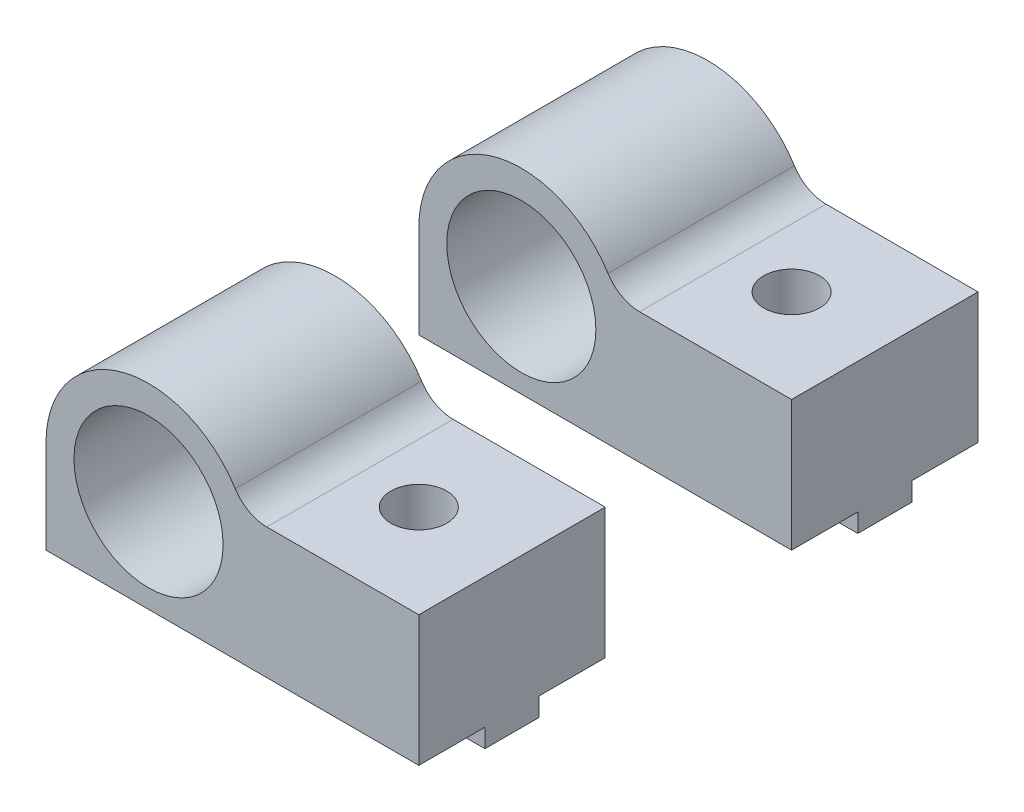
ISO-10303-21;
HEADER;
FILE_DESCRIPTION(('STEP AP214'),'2;1');
FILE_NAME('part.step','',(''),(''),'','','');
FILE_SCHEMA(('AUTOMOTIVE_DESIGN { 1 0 10303 214 1 1 1 1 }'));
ENDSEC;
DATA;
#1=APPLICATION_CONTEXT('core data for automotive mechanical design processes');
#2=APPLICATION_PROTOCOL_DEFINITION('international standard','automotive_design',2000,#1);
#3=PRODUCT_CONTEXT('',#1,'mechanical');
#4=PRODUCT('Part','Part','',(#3));
#5=PRODUCT_RELATED_PRODUCT_CATEGORY('part','',(#4));
#6=PRODUCT_DEFINITION_FORMATION('','',#4);
#7=PRODUCT_DEFINITION_CONTEXT('part definition',#1,'design');
#8=PRODUCT_DEFINITION('design','',#6,#7);
#9=PRODUCT_DEFINITION_SHAPE('','',#8);
#10=(LENGTH_UNIT() NAMED_UNIT(*) SI_UNIT(.MILLI.,.METRE.));
#11=(NAMED_UNIT(*) PLANE_ANGLE_UNIT() SI_UNIT($,.RADIAN.));
#12=(NAMED_UNIT(*) SI_UNIT($,.STERADIAN.) SOLID_ANGLE_UNIT());
#13=UNCERTAINTY_MEASURE_WITH_UNIT(LENGTH_MEASURE(1.E-05),#10,'distance_accuracy_value','');
#14=(GEOMETRIC_REPRESENTATION_CONTEXT(3) GLOBAL_UNCERTAINTY_ASSIGNED_CONTEXT((#13)) GLOBAL_UNIT_ASSIGNED_CONTEXT((#10,
#11,#12)) REPRESENTATION_CONTEXT('',''));
#15=CARTESIAN_POINT('',(0.,0.,0.));
#16=DIRECTION('',(0.,0.,1.));
#17=DIRECTION('',(1.,0.,0.));
#18=AXIS2_PLACEMENT_3D('',#15,#16,#17);
#19=CARTESIAN_POINT('',(-5.5,-6.,-16.45));
#20=DIRECTION('',(0.,0.,1.));
#21=DIRECTION('',(1.,0.,0.));
#22=AXIS2_PLACEMENT_3D('',#19,#20,#21);
#23=PLANE('',#22);
#24=DIRECTION('',(1.,0.,0.));
#25=VECTOR('',#24,1.);
#26=CARTESIAN_POINT('',(-5.5,-6.,-16.45));
#27=LINE('',#26,#25);
#28=CARTESIAN_POINT('',(9.88405728739344,-6.,-16.45));
#29=VERTEX_POINT('',#28);
#30=CARTESIAN_POINT('',(14.5,-6.,-16.45));
#31=VERTEX_POINT('',#30);
#32=EDGE_CURVE('E307',#29,#31,#27,.T.);
#33=ORIENTED_EDGE('',*,*,#32,.F.);
#34=DIRECTION('',(0.,1.,0.));
#35=VECTOR('',#34,1.);
#36=CARTESIAN_POINT('',(9.88405728739344,-6.,-16.45));
#37=LINE('',#36,#35);
#38=CARTESIAN_POINT('',(9.88405728739344,-5.,-16.45));
#39=VERTEX_POINT('',#38);
#40=EDGE_CURVE('E153',#29,#39,#37,.T.);
#41=ORIENTED_EDGE('',*,*,#40,.T.);
#42=DIRECTION('',(1.,0.,0.));
#43=VECTOR('',#42,1.);
#44=CARTESIAN_POINT('',(-5.5,-5.,-16.45));
#45=LINE('',#44,#43);
#46=CARTESIAN_POINT('',(14.5,-5.,-16.45));
#47=VERTEX_POINT('',#46);
#48=EDGE_CURVE('E187',#39,#47,#45,.T.);
#49=ORIENTED_EDGE('',*,*,#48,.T.);
#50=DIRECTION('',(0.,1.,0.));
#51=VECTOR('',#50,1.);
#52=CARTESIAN_POINT('',(14.5,-6.,-16.45));
#53=LINE('',#52,#51);
#54=EDGE_CURVE('E191',#31,#47,#53,.T.);
#55=ORIENTED_EDGE('',*,*,#54,.F.);
#56=EDGE_LOOP('',(#33,#41,#49,#55));
#57=FACE_BOUND('',#56,.T.);
#58=ADVANCED_FACE('F47',(#57),#23,.F.);
#59=CARTESIAN_POINT('',(-5.5,-6.,-13.55));
#60=DIRECTION('',(0.,0.,-1.));
#61=DIRECTION('',(-1.,0.,0.));
#62=AXIS2_PLACEMENT_3D('',#59,#60,#61);
#63=PLANE('',#62);
#64=DIRECTION('',(-1.,0.,0.));
#65=VECTOR('',#64,1.);
#66=CARTESIAN_POINT('',(-5.5,-6.,-13.55));
#67=LINE('',#66,#65);
#68=CARTESIAN_POINT('',(9.11594271260658,-6.,-13.55));
#69=VERTEX_POINT('',#68);
#70=CARTESIAN_POINT('',(-5.5,-6.,-13.55));
#71=VERTEX_POINT('',#70);
#72=EDGE_CURVE('E175',#69,#71,#67,.T.);
#73=ORIENTED_EDGE('',*,*,#72,.F.);
#74=DIRECTION('',(0.,1.,0.));
#75=VECTOR('',#74,1.);
#76=CARTESIAN_POINT('',(9.11594271260658,-6.,-13.55));
#77=LINE('',#76,#75);
#78=CARTESIAN_POINT('',(9.11594271260658,-5.,-13.55));
#79=VERTEX_POINT('',#78);
#80=EDGE_CURVE('E302',#69,#79,#77,.T.);
#81=ORIENTED_EDGE('',*,*,#80,.T.);
#82=DIRECTION('',(-1.,0.,0.));
#83=VECTOR('',#82,1.);
#84=CARTESIAN_POINT('',(-5.5,-5.,-13.55));
#85=LINE('',#84,#83);
#86=CARTESIAN_POINT('',(-5.5,-5.,-13.55));
#87=VERTEX_POINT('',#86);
#88=EDGE_CURVE('E186',#79,#87,#85,.T.);
#89=ORIENTED_EDGE('',*,*,#88,.T.);
#90=DIRECTION('',(0.,1.,0.));
#91=VECTOR('',#90,1.);
#92=CARTESIAN_POINT('',(-5.5,-6.,-13.55));
#93=LINE('',#92,#91);
#94=EDGE_CURVE('E174',#71,#87,#93,.T.);
#95=ORIENTED_EDGE('',*,*,#94,.F.);
#96=EDGE_LOOP('',(#73,#81,#89,#95));
#97=FACE_BOUND('',#96,.T.);
#98=ADVANCED_FACE('F272',(#97),#63,.F.);
#99=CARTESIAN_POINT('',(0.,-6.,-20.));
#100=DIRECTION('',(0.,-1.,0.));
#101=DIRECTION('',(0.,0.,-1.));
#102=AXIS2_PLACEMENT_3D('',#99,#100,#101);
#103=PLANE('',#102);
#104=CARTESIAN_POINT('',(9.50000000000001,-6.,-15.));
#105=DIRECTION('',(0.,-1.,0.));
#106=DIRECTION('',(0.,0.,-1.));
#107=AXIS2_PLACEMENT_3D('',#104,#105,#106);
#108=CIRCLE('',#107,1.5);
#109=CARTESIAN_POINT('',(9.88405728739344,-6.,-13.55));
#110=VERTEX_POINT('',#109);
#111=EDGE_CURVE('E147',#29,#110,#108,.T.);
#112=ORIENTED_EDGE('',*,*,#111,.F.);
#113=ORIENTED_EDGE('',*,*,#32,.T.);
#114=DIRECTION('',(0.,0.,1.));
#115=VECTOR('',#114,1.);
#116=CARTESIAN_POINT('',(14.5,-6.,-13.55));
#117=LINE('',#116,#115);
#118=CARTESIAN_POINT('',(14.5,-6.,-13.55));
#119=VERTEX_POINT('',#118);
#120=EDGE_CURVE('E172',#31,#119,#117,.T.);
#121=ORIENTED_EDGE('',*,*,#120,.T.);
#122=EDGE_CURVE('E165',#119,#110,#67,.T.);
#123=ORIENTED_EDGE('',*,*,#122,.T.);
#124=EDGE_LOOP('',(#112,#113,#121,#123));
#125=FACE_BOUND('',#124,.T.);
#126=ADVANCED_FACE('F170',(#125),#103,.T.);
#127=CARTESIAN_POINT('',(-5.5,-5.,-10.));
#128=DIRECTION('',(0.,1.,0.));
#129=DIRECTION('',(0.,0.,1.));
#130=AXIS2_PLACEMENT_3D('',#127,#128,#129);
#131=PLANE('',#130);
#132=ORIENTED_EDGE('',*,*,#88,.F.);
#133=CARTESIAN_POINT('',(9.50000000000001,-5.,-15.));
#134=DIRECTION('',(0.,1.,0.));
#135=DIRECTION('',(0.,0.,1.));
#136=AXIS2_PLACEMENT_3D('',#133,#134,#135);
#137=CIRCLE('',#136,1.5);
#138=CARTESIAN_POINT('',(9.88405728739344,-5.,-13.55));
#139=VERTEX_POINT('',#138);
#140=EDGE_CURVE('E167',#79,#139,#137,.T.);
#141=ORIENTED_EDGE('',*,*,#140,.T.);
#142=CARTESIAN_POINT('',(14.5,-5.,-13.55));
#143=VERTEX_POINT('',#142);
#144=EDGE_CURVE('E166',#143,#139,#85,.T.);
#145=ORIENTED_EDGE('',*,*,#144,.F.);
#146=DIRECTION('',(0.,0.,-1.));
#147=VECTOR('',#146,1.);
#148=CARTESIAN_POINT('',(14.5,-5.,-10.));
#149=LINE('',#148,#147);
#150=CARTESIAN_POINT('',(14.5,-5.,-10.));
#151=VERTEX_POINT('',#150);
#152=EDGE_CURVE('E229',#151,#143,#149,.T.);
#153=ORIENTED_EDGE('',*,*,#152,.F.);
#154=DIRECTION('',(1.,0.,0.));
#155=VECTOR('',#154,1.);
#156=CARTESIAN_POINT('',(-5.5,-5.,-10.));
#157=LINE('',#156,#155);
#158=CARTESIAN_POINT('',(-5.5,-5.,-10.));
#159=VERTEX_POINT('',#158);
#160=EDGE_CURVE('E211',#159,#151,#157,.T.);
#161=ORIENTED_EDGE('',*,*,#160,.F.);
#162=DIRECTION('',(0.,0.,-1.));
#163=VECTOR('',#162,1.);
#164=CARTESIAN_POINT('',(-5.5,-5.,-10.));
#165=LINE('',#164,#163);
#166=EDGE_CURVE('E233',#159,#87,#165,.T.);
#167=ORIENTED_EDGE('',*,*,#166,.T.);
#168=EDGE_LOOP('',(#132,#141,#145,#153,#161,#167));
#169=FACE_BOUND('',#168,.T.);
#170=ADVANCED_FACE('F317',(#169),#131,.F.);
#171=ORIENTED_EDGE('',*,*,#48,.F.);
#172=CARTESIAN_POINT('',(9.50000000000001,-5.,-15.));
#173=DIRECTION('',(0.,1.,0.));
#174=DIRECTION('',(0.,0.,1.));
#175=AXIS2_PLACEMENT_3D('',#172,#173,#174);
#176=CIRCLE('',#175,1.5);
#177=CARTESIAN_POINT('',(9.11594271260657,-5.,-16.45));
#178=VERTEX_POINT('',#177);
#179=EDGE_CURVE('E298',#39,#178,#176,.T.);
#180=ORIENTED_EDGE('',*,*,#179,.T.);
#181=CARTESIAN_POINT('',(-5.5,-5.,-16.45));
#182=VERTEX_POINT('',#181);
#183=EDGE_CURVE('E183',#182,#178,#45,.T.);
#184=ORIENTED_EDGE('',*,*,#183,.F.);
#185=CARTESIAN_POINT('',(-5.5,-5.,-20.));
#186=VERTEX_POINT('',#185);
#187=EDGE_CURVE('E232',#182,#186,#165,.T.);
#188=ORIENTED_EDGE('',*,*,#187,.T.);
#189=DIRECTION('',(1.,0.,0.));
#190=VECTOR('',#189,1.);
#191=CARTESIAN_POINT('',(-5.5,-5.,-20.));
#192=LINE('',#191,#190);
#193=CARTESIAN_POINT('',(14.5,-5.,-20.));
#194=VERTEX_POINT('',#193);
#195=EDGE_CURVE('E222',#186,#194,#192,.T.);
#196=ORIENTED_EDGE('',*,*,#195,.T.);
#197=EDGE_CURVE('E228',#47,#194,#149,.T.);
#198=ORIENTED_EDGE('',*,*,#197,.F.);
#199=EDGE_LOOP('',(#171,#180,#184,#188,#196,#198));
#200=FACE_BOUND('',#199,.T.);
#201=ADVANCED_FACE('F297',(#200),#131,.F.);
#202=CARTESIAN_POINT('',(0.,0.,-10.));
#203=DIRECTION('',(0.,0.,-1.));
#204=DIRECTION('',(-1.,0.,0.));
#205=AXIS2_PLACEMENT_3D('',#202,#203,#204);
#206=PLANE('',#205);
#207=DIRECTION('',(-1.,0.,0.));
#208=VECTOR('',#207,1.);
#209=CARTESIAN_POINT('',(14.5,2.,-10.));
#210=LINE('',#209,#208);
#211=CARTESIAN_POINT('',(14.5,2.,-10.));
#212=VERTEX_POINT('',#211);
#213=CARTESIAN_POINT('',(6.34428877022476,2.,-10.));
#214=VERTEX_POINT('',#213);
#215=EDGE_CURVE('E204',#212,#214,#210,.T.);
#216=ORIENTED_EDGE('',*,*,#215,.T.);
#217=CARTESIAN_POINT('',(6.34428877022476,4.,-10.));
#218=DIRECTION('',(0.,0.,-1.));
#219=DIRECTION('',(-1.,0.,0.));
#220=AXIS2_PLACEMENT_3D('',#217,#218,#219);
#221=CIRCLE('',#220,2.);
#222=CARTESIAN_POINT('',(4.65247843149816,2.93333333333333,-10.));
#223=VERTEX_POINT('',#222);
#224=EDGE_CURVE('E12',#214,#223,#221,.T.);
#225=ORIENTED_EDGE('',*,*,#224,.T.);
#226=CARTESIAN_POINT('',(0.,0.,-10.));
#227=DIRECTION('',(0.,0.,1.));
#228=DIRECTION('',(-1.,0.,0.));
#229=AXIS2_PLACEMENT_3D('',#226,#227,#228);
#230=CIRCLE('',#229,5.5);
#231=CARTESIAN_POINT('',(-5.5,0.,-10.));
#232=VERTEX_POINT('',#231);
#233=EDGE_CURVE('E206',#223,#232,#230,.T.);
#234=ORIENTED_EDGE('',*,*,#233,.T.);
#235=DIRECTION('',(0.,-1.,0.));
#236=VECTOR('',#235,1.);
#237=CARTESIAN_POINT('',(-5.5,0.,-10.));
#238=LINE('',#237,#236);
#239=EDGE_CURVE('E209',#232,#159,#238,.T.);
#240=ORIENTED_EDGE('',*,*,#239,.T.);
#241=ORIENTED_EDGE('',*,*,#160,.T.);
#242=DIRECTION('',(0.,1.,0.));
#243=VECTOR('',#242,1.);
#244=CARTESIAN_POINT('',(14.5,-5.,-10.));
#245=LINE('',#244,#243);
#246=EDGE_CURVE('E213',#151,#212,#245,.T.);
#247=ORIENTED_EDGE('',*,*,#246,.T.);
#248=EDGE_LOOP('',(#216,#225,#234,#240,#241,#247));
#249=FACE_BOUND('',#248,.T.);
#250=CARTESIAN_POINT('',(0.,0.,-10.));
#251=DIRECTION('',(0.,0.,1.));
#252=DIRECTION('',(1.,0.,0.));
#253=AXIS2_PLACEMENT_3D('',#250,#251,#252);
#254=CIRCLE('',#253,4.);
#255=CARTESIAN_POINT('',(4.,0.,-10.));
#256=VERTEX_POINT('',#255);
#257=EDGE_CURVE('E198',#256,#256,#254,.T.);
#258=ORIENTED_EDGE('',*,*,#257,.F.);
#259=EDGE_LOOP('',(#258));
#260=FACE_BOUND('',#259,.T.);
#261=ADVANCED_FACE('F261',(#249,#260),#206,.F.);
#262=CARTESIAN_POINT('',(0.,0.,-20.));
#263=DIRECTION('',(0.,0.,-1.));
#264=DIRECTION('',(-1.,0.,0.));
#265=AXIS2_PLACEMENT_3D('',#262,#263,#264);
#266=PLANE('',#265);
#267=DIRECTION('',(-1.,0.,0.));
#268=VECTOR('',#267,1.);
#269=CARTESIAN_POINT('',(14.5,2.,-20.));
#270=LINE('',#269,#268);
#271=CARTESIAN_POINT('',(14.5,2.,-20.));
#272=VERTEX_POINT('',#271);
#273=CARTESIAN_POINT('',(6.34428877022476,2.,-20.));
#274=VERTEX_POINT('',#273);
#275=EDGE_CURVE('E201',#272,#274,#270,.T.);
#276=ORIENTED_EDGE('',*,*,#275,.F.);
#277=DIRECTION('',(0.,1.,0.));
#278=VECTOR('',#277,1.);
#279=CARTESIAN_POINT('',(14.5,-5.,-20.));
#280=LINE('',#279,#278);
#281=EDGE_CURVE('E207',#194,#272,#280,.T.);
#282=ORIENTED_EDGE('',*,*,#281,.F.);
#283=ORIENTED_EDGE('',*,*,#195,.F.);
#284=DIRECTION('',(0.,-1.,0.));
#285=VECTOR('',#284,1.);
#286=CARTESIAN_POINT('',(-5.5,0.,-20.));
#287=LINE('',#286,#285);
#288=CARTESIAN_POINT('',(-5.5,0.,-20.));
#289=VERTEX_POINT('',#288);
#290=EDGE_CURVE('E219',#289,#186,#287,.T.);
#291=ORIENTED_EDGE('',*,*,#290,.F.);
#292=CARTESIAN_POINT('',(0.,0.,-20.));
#293=DIRECTION('',(0.,0.,1.));
#294=DIRECTION('',(-1.,0.,0.));
#295=AXIS2_PLACEMENT_3D('',#292,#293,#294);
#296=CIRCLE('',#295,5.5);
#297=CARTESIAN_POINT('',(4.65247843149816,2.93333333333333,-20.));
#298=VERTEX_POINT('',#297);
#299=EDGE_CURVE('E217',#298,#289,#296,.T.);
#300=ORIENTED_EDGE('',*,*,#299,.F.);
#301=CARTESIAN_POINT('',(6.34428877022476,4.,-20.));
#302=DIRECTION('',(0.,0.,-1.));
#303=DIRECTION('',(-1.,0.,0.));
#304=AXIS2_PLACEMENT_3D('',#301,#302,#303);
#305=CIRCLE('',#304,2.);
#306=EDGE_CURVE('E55',#298,#274,#305,.F.);
#307=ORIENTED_EDGE('',*,*,#306,.T.);
#308=EDGE_LOOP('',(#276,#282,#283,#291,#300,#307));
#309=FACE_BOUND('',#308,.T.);
#310=CARTESIAN_POINT('',(0.,0.,-20.));
#311=DIRECTION('',(0.,0.,1.));
#312=DIRECTION('',(1.,0.,0.));
#313=AXIS2_PLACEMENT_3D('',#310,#311,#312);
#314=CIRCLE('',#313,4.);
#315=CARTESIAN_POINT('',(4.,0.,-20.));
#316=VERTEX_POINT('',#315);
#317=EDGE_CURVE('E197',#316,#316,#314,.T.);
#318=ORIENTED_EDGE('',*,*,#317,.T.);
#319=EDGE_LOOP('',(#318));
#320=FACE_BOUND('',#319,.T.);
#321=ADVANCED_FACE('F249',(#309,#320),#266,.T.);
#322=CARTESIAN_POINT('',(14.5,2.,-10.));
#323=DIRECTION('',(0.,-1.,0.));
#324=DIRECTION('',(1.,0.,0.));
#325=AXIS2_PLACEMENT_3D('',#322,#323,#324);
#326=PLANE('',#325);
#327=CARTESIAN_POINT('',(9.50000000000001,2.,-15.));
#328=DIRECTION('',(0.,1.,0.));
#329=DIRECTION('',(-1.,0.,0.));
#330=AXIS2_PLACEMENT_3D('',#327,#328,#329);
#331=CIRCLE('',#330,1.5);
#332=CARTESIAN_POINT('',(8.,2.,-15.));
#333=VERTEX_POINT('',#332);
#334=EDGE_CURVE('E168',#333,#333,#331,.T.);
#335=ORIENTED_EDGE('',*,*,#334,.F.);
#336=EDGE_LOOP('',(#335));
#337=FACE_BOUND('',#336,.T.);
#338=ORIENTED_EDGE('',*,*,#275,.T.);
#339=DIRECTION('',(0.,0.,1.));
#340=VECTOR('',#339,1.);
#341=CARTESIAN_POINT('',(6.34428877022476,2.,-10.));
#342=LINE('',#341,#340);
#343=EDGE_CURVE('E62',#274,#214,#342,.T.);
#344=ORIENTED_EDGE('',*,*,#343,.T.);
#345=ORIENTED_EDGE('',*,*,#215,.F.);
#346=DIRECTION('',(0.,0.,-1.));
#347=VECTOR('',#346,1.);
#348=CARTESIAN_POINT('',(14.5,2.,-10.));
#349=LINE('',#348,#347);
#350=EDGE_CURVE('E215',#212,#272,#349,.T.);
#351=ORIENTED_EDGE('',*,*,#350,.T.);
#352=EDGE_LOOP('',(#338,#344,#345,#351));
#353=FACE_BOUND('',#352,.T.);
#354=ADVANCED_FACE('F324',(#337,#353),#326,.F.);
#355=CARTESIAN_POINT('',(0.,0.,-10.));
#356=DIRECTION('',(0.,0.,-1.));
#357=DIRECTION('',(-1.,0.,0.));
#358=AXIS2_PLACEMENT_3D('',#355,#356,#357);
#359=CYLINDRICAL_SURFACE('',#358,5.5);
#360=ORIENTED_EDGE('',*,*,#233,.F.);
#361=DIRECTION('',(0.,0.,-1.));
#362=VECTOR('',#361,1.);
#363=CARTESIAN_POINT('',(4.65247843149816,2.93333333333333,-10.));
#364=LINE('',#363,#362);
#365=EDGE_CURVE('E157',#223,#298,#364,.T.);
#366=ORIENTED_EDGE('',*,*,#365,.T.);
#367=ORIENTED_EDGE('',*,*,#299,.T.);
#368=DIRECTION('',(0.,0.,-1.));
#369=VECTOR('',#368,1.);
#370=CARTESIAN_POINT('',(-5.5,0.,-10.));
#371=LINE('',#370,#369);
#372=EDGE_CURVE('E236',#232,#289,#371,.T.);
#373=ORIENTED_EDGE('',*,*,#372,.F.);
#374=EDGE_LOOP('',(#360,#366,#367,#373));
#375=FACE_BOUND('',#374,.T.);
#376=ADVANCED_FACE('F244',(#375),#359,.T.);
#377=CARTESIAN_POINT('',(-5.5,0.,-10.));
#378=DIRECTION('',(1.,0.,0.));
#379=DIRECTION('',(0.,1.,0.));
#380=AXIS2_PLACEMENT_3D('',#377,#378,#379);
#381=PLANE('',#380);
#382=ORIENTED_EDGE('',*,*,#290,.T.);
#383=ORIENTED_EDGE('',*,*,#187,.F.);
#384=DIRECTION('',(0.,1.,0.));
#385=VECTOR('',#384,1.);
#386=CARTESIAN_POINT('',(-5.5,-6.,-16.45));
#387=LINE('',#386,#385);
#388=CARTESIAN_POINT('',(-5.5,-6.,-16.45));
#389=VERTEX_POINT('',#388);
#390=EDGE_CURVE('E194',#389,#182,#387,.T.);
#391=ORIENTED_EDGE('',*,*,#390,.F.);
#392=DIRECTION('',(0.,0.,-1.));
#393=VECTOR('',#392,1.);
#394=CARTESIAN_POINT('',(-5.5,-6.,-13.55));
#395=LINE('',#394,#393);
#396=EDGE_CURVE('E188',#71,#389,#395,.T.);
#397=ORIENTED_EDGE('',*,*,#396,.F.);
#398=ORIENTED_EDGE('',*,*,#94,.T.);
#399=ORIENTED_EDGE('',*,*,#166,.F.);
#400=ORIENTED_EDGE('',*,*,#239,.F.);
#401=ORIENTED_EDGE('',*,*,#372,.T.);
#402=EDGE_LOOP('',(#382,#383,#391,#397,#398,#399,#400,#401));
#403=FACE_BOUND('',#402,.T.);
#404=ADVANCED_FACE('F255',(#403),#381,.F.);
#405=CARTESIAN_POINT('',(14.5,-5.,-10.));
#406=DIRECTION('',(-1.,0.,0.));
#407=DIRECTION('',(0.,-1.,0.));
#408=AXIS2_PLACEMENT_3D('',#405,#406,#407);
#409=PLANE('',#408);
#410=ORIENTED_EDGE('',*,*,#281,.T.);
#411=ORIENTED_EDGE('',*,*,#350,.F.);
#412=ORIENTED_EDGE('',*,*,#246,.F.);
#413=ORIENTED_EDGE('',*,*,#152,.T.);
#414=DIRECTION('',(0.,1.,0.));
#415=VECTOR('',#414,1.);
#416=CARTESIAN_POINT('',(14.5,-6.,-13.55));
#417=LINE('',#416,#415);
#418=EDGE_CURVE('E178',#119,#143,#417,.T.);
#419=ORIENTED_EDGE('',*,*,#418,.F.);
#420=ORIENTED_EDGE('',*,*,#120,.F.);
#421=ORIENTED_EDGE('',*,*,#54,.T.);
#422=ORIENTED_EDGE('',*,*,#197,.T.);
#423=EDGE_LOOP('',(#410,#411,#412,#413,#419,#420,#421,#422));
#424=FACE_BOUND('',#423,.T.);
#425=ADVANCED_FACE('F289',(#424),#409,.F.);
#426=CARTESIAN_POINT('',(0.,0.,-10.));
#427=DIRECTION('',(0.,0.,-1.));
#428=DIRECTION('',(-1.,0.,0.));
#429=AXIS2_PLACEMENT_3D('',#426,#427,#428);
#430=CYLINDRICAL_SURFACE('',#429,4.);
#431=ORIENTED_EDGE('',*,*,#257,.T.);
#432=EDGE_LOOP('',(#431));
#433=FACE_BOUND('',#432,.T.);
#434=ORIENTED_EDGE('',*,*,#317,.F.);
#435=EDGE_LOOP('',(#434));
#436=FACE_BOUND('',#435,.T.);
#437=ADVANCED_FACE('F283',(#433,#436),#430,.F.);
#438=ORIENTED_EDGE('',*,*,#183,.T.);
#439=DIRECTION('',(0.,1.,0.));
#440=VECTOR('',#439,1.);
#441=CARTESIAN_POINT('',(9.11594271260657,-6.,-16.45));
#442=LINE('',#441,#440);
#443=CARTESIAN_POINT('',(9.11594271260657,-6.,-16.45));
#444=VERTEX_POINT('',#443);
#445=EDGE_CURVE('E292',#178,#444,#442,.F.);
#446=ORIENTED_EDGE('',*,*,#445,.T.);
#447=EDGE_CURVE('E308',#389,#444,#27,.T.);
#448=ORIENTED_EDGE('',*,*,#447,.F.);
#449=ORIENTED_EDGE('',*,*,#390,.T.);
#450=EDGE_LOOP('',(#438,#446,#448,#449));
#451=FACE_BOUND('',#450,.T.);
#452=ADVANCED_FACE('F275',(#451),#23,.F.);
#453=ORIENTED_EDGE('',*,*,#144,.T.);
#454=DIRECTION('',(0.,1.,0.));
#455=VECTOR('',#454,1.);
#456=CARTESIAN_POINT('',(9.88405728739344,-6.,-13.55));
#457=LINE('',#456,#455);
#458=EDGE_CURVE('E150',#139,#110,#457,.F.);
#459=ORIENTED_EDGE('',*,*,#458,.T.);
#460=ORIENTED_EDGE('',*,*,#122,.F.);
#461=ORIENTED_EDGE('',*,*,#418,.T.);
#462=EDGE_LOOP('',(#453,#459,#460,#461));
#463=FACE_BOUND('',#462,.T.);
#464=ADVANCED_FACE('F163',(#463),#63,.F.);
#465=EDGE_CURVE('E158',#69,#444,#108,.T.);
#466=ORIENTED_EDGE('',*,*,#465,.F.);
#467=ORIENTED_EDGE('',*,*,#72,.T.);
#468=ORIENTED_EDGE('',*,*,#396,.T.);
#469=ORIENTED_EDGE('',*,*,#447,.T.);
#470=EDGE_LOOP('',(#466,#467,#468,#469));
#471=FACE_BOUND('',#470,.T.);
#472=ADVANCED_FACE('F268',(#471),#103,.T.);
#473=CARTESIAN_POINT('',(9.50000000000001,-6.,-15.));
#474=DIRECTION('',(0.,1.,0.));
#475=DIRECTION('',(-1.,0.,0.));
#476=AXIS2_PLACEMENT_3D('',#473,#474,#475);
#477=CYLINDRICAL_SURFACE('',#476,1.5);
#478=ORIENTED_EDGE('',*,*,#334,.T.);
#479=EDGE_LOOP('',(#478));
#480=FACE_BOUND('',#479,.T.);
#481=ORIENTED_EDGE('',*,*,#111,.T.);
#482=ORIENTED_EDGE('',*,*,#458,.F.);
#483=ORIENTED_EDGE('',*,*,#140,.F.);
#484=ORIENTED_EDGE('',*,*,#80,.F.);
#485=ORIENTED_EDGE('',*,*,#465,.T.);
#486=ORIENTED_EDGE('',*,*,#445,.F.);
#487=ORIENTED_EDGE('',*,*,#179,.F.);
#488=ORIENTED_EDGE('',*,*,#40,.F.);
#489=EDGE_LOOP('',(#481,#482,#483,#484,#485,#486,#487,#488));
#490=FACE_BOUND('',#489,.T.);
#491=ADVANCED_FACE('F149',(#480,#490),#477,.F.);
#492=CARTESIAN_POINT('',(6.34428877022476,4.,-10.));
#493=DIRECTION('',(0.,0.,-1.));
#494=DIRECTION('',(-1.,0.,0.));
#495=AXIS2_PLACEMENT_3D('',#492,#493,#494);
#496=CYLINDRICAL_SURFACE('',#495,2.);
#497=ORIENTED_EDGE('',*,*,#224,.F.);
#498=ORIENTED_EDGE('',*,*,#343,.F.);
#499=ORIENTED_EDGE('',*,*,#306,.F.);
#500=ORIENTED_EDGE('',*,*,#365,.F.);
#501=EDGE_LOOP('',(#497,#498,#499,#500));
#502=FACE_BOUND('',#501,.T.);
#503=ADVANCED_FACE('F49',(#502),#496,.F.);
#504=CLOSED_SHELL('',(#58,#98,#126,#170,#201,#261,#321,#354,#376,#404,#425,#437,#452,#464,#472,
#491,#503));
#505=MANIFOLD_SOLID_BREP('B2_NOT_SHOWN',#504);
#506=CARTESIAN_POINT('',(-5.5,-6.,3.55));
#507=DIRECTION('',(0.,0.,1.));
#508=DIRECTION('',(1.,0.,0.));
#509=AXIS2_PLACEMENT_3D('',#506,#507,#508);
#510=PLANE('',#509);
#511=DIRECTION('',(1.,0.,0.));
#512=VECTOR('',#511,1.);
#513=CARTESIAN_POINT('',(-5.5,-6.,3.55));
#514=LINE('',#513,#512);
#515=CARTESIAN_POINT('',(9.88405728739344,-6.,3.55));
#516=VERTEX_POINT('',#515);
#517=CARTESIAN_POINT('',(14.5,-6.,3.55));
#518=VERTEX_POINT('',#517);
#519=EDGE_CURVE('E713',#516,#518,#514,.T.);
#520=ORIENTED_EDGE('',*,*,#519,.F.);
#521=DIRECTION('',(0.,1.,0.));
#522=VECTOR('',#521,1.);
#523=CARTESIAN_POINT('',(9.88405728739344,-6.,3.55));
#524=LINE('',#523,#522);
#525=CARTESIAN_POINT('',(9.88405728739344,-5.,3.55));
#526=VERTEX_POINT('',#525);
#527=EDGE_CURVE('E559',#516,#526,#524,.T.);
#528=ORIENTED_EDGE('',*,*,#527,.T.);
#529=DIRECTION('',(1.,0.,0.));
#530=VECTOR('',#529,1.);
#531=CARTESIAN_POINT('',(-5.5,-5.,3.55));
#532=LINE('',#531,#530);
#533=CARTESIAN_POINT('',(14.5,-5.,3.55));
#534=VERTEX_POINT('',#533);
#535=EDGE_CURVE('E593',#526,#534,#532,.T.);
#536=ORIENTED_EDGE('',*,*,#535,.T.);
#537=DIRECTION('',(0.,1.,0.));
#538=VECTOR('',#537,1.);
#539=CARTESIAN_POINT('',(14.5,-6.,3.55));
#540=LINE('',#539,#538);
#541=EDGE_CURVE('E597',#518,#534,#540,.T.);
#542=ORIENTED_EDGE('',*,*,#541,.F.);
#543=EDGE_LOOP('',(#520,#528,#536,#542));
#544=FACE_BOUND('',#543,.T.);
#545=ADVANCED_FACE('F453',(#544),#510,.F.);
#546=CARTESIAN_POINT('',(-5.5,-6.,6.45));
#547=DIRECTION('',(0.,0.,-1.));
#548=DIRECTION('',(-1.,0.,0.));
#549=AXIS2_PLACEMENT_3D('',#546,#547,#548);
#550=PLANE('',#549);
#551=DIRECTION('',(-1.,0.,0.));
#552=VECTOR('',#551,1.);
#553=CARTESIAN_POINT('',(-5.5,-6.,6.45));
#554=LINE('',#553,#552);
#555=CARTESIAN_POINT('',(9.11594271260658,-6.,6.45));
#556=VERTEX_POINT('',#555);
#557=CARTESIAN_POINT('',(-5.5,-6.,6.45));
#558=VERTEX_POINT('',#557);
#559=EDGE_CURVE('E581',#556,#558,#554,.T.);
#560=ORIENTED_EDGE('',*,*,#559,.F.);
#561=DIRECTION('',(0.,1.,0.));
#562=VECTOR('',#561,1.);
#563=CARTESIAN_POINT('',(9.11594271260658,-6.,6.45));
#564=LINE('',#563,#562);
#565=CARTESIAN_POINT('',(9.11594271260658,-5.,6.45));
#566=VERTEX_POINT('',#565);
#567=EDGE_CURVE('E708',#556,#566,#564,.T.);
#568=ORIENTED_EDGE('',*,*,#567,.T.);
#569=DIRECTION('',(-1.,0.,0.));
#570=VECTOR('',#569,1.);
#571=CARTESIAN_POINT('',(-5.5,-5.,6.45));
#572=LINE('',#571,#570);
#573=CARTESIAN_POINT('',(-5.5,-5.,6.45));
#574=VERTEX_POINT('',#573);
#575=EDGE_CURVE('E592',#566,#574,#572,.T.);
#576=ORIENTED_EDGE('',*,*,#575,.T.);
#577=DIRECTION('',(0.,1.,0.));
#578=VECTOR('',#577,1.);
#579=CARTESIAN_POINT('',(-5.5,-6.,6.45));
#580=LINE('',#579,#578);
#581=EDGE_CURVE('E580',#558,#574,#580,.T.);
#582=ORIENTED_EDGE('',*,*,#581,.F.);
#583=EDGE_LOOP('',(#560,#568,#576,#582));
#584=FACE_BOUND('',#583,.T.);
#585=ADVANCED_FACE('F678',(#584),#550,.F.);
#586=CARTESIAN_POINT('',(0.,-6.,0.));
#587=DIRECTION('',(0.,-1.,0.));
#588=DIRECTION('',(0.,0.,-1.));
#589=AXIS2_PLACEMENT_3D('',#586,#587,#588);
#590=PLANE('',#589);
#591=CARTESIAN_POINT('',(9.50000000000001,-6.,5.));
#592=DIRECTION('',(0.,-1.,0.));
#593=DIRECTION('',(0.,0.,-1.));
#594=AXIS2_PLACEMENT_3D('',#591,#592,#593);
#595=CIRCLE('',#594,1.5);
#596=CARTESIAN_POINT('',(9.88405728739344,-6.,6.45));
#597=VERTEX_POINT('',#596);
#598=EDGE_CURVE('E553',#516,#597,#595,.T.);
#599=ORIENTED_EDGE('',*,*,#598,.F.);
#600=ORIENTED_EDGE('',*,*,#519,.T.);
#601=DIRECTION('',(0.,0.,1.));
#602=VECTOR('',#601,1.);
#603=CARTESIAN_POINT('',(14.5,-6.,6.45));
#604=LINE('',#603,#602);
#605=CARTESIAN_POINT('',(14.5,-6.,6.45));
#606=VERTEX_POINT('',#605);
#607=EDGE_CURVE('E578',#518,#606,#604,.T.);
#608=ORIENTED_EDGE('',*,*,#607,.T.);
#609=EDGE_CURVE('E571',#606,#597,#554,.T.);
#610=ORIENTED_EDGE('',*,*,#609,.T.);
#611=EDGE_LOOP('',(#599,#600,#608,#610));
#612=FACE_BOUND('',#611,.T.);
#613=ADVANCED_FACE('F576',(#612),#590,.T.);
#614=CARTESIAN_POINT('',(-5.5,-5.,10.));
#615=DIRECTION('',(0.,1.,0.));
#616=DIRECTION('',(0.,0.,1.));
#617=AXIS2_PLACEMENT_3D('',#614,#615,#616);
#618=PLANE('',#617);
#619=ORIENTED_EDGE('',*,*,#575,.F.);
#620=CARTESIAN_POINT('',(9.50000000000001,-5.,5.));
#621=DIRECTION('',(0.,1.,0.));
#622=DIRECTION('',(0.,0.,1.));
#623=AXIS2_PLACEMENT_3D('',#620,#621,#622);
#624=CIRCLE('',#623,1.5);
#625=CARTESIAN_POINT('',(9.88405728739344,-5.,6.45));
#626=VERTEX_POINT('',#625);
#627=EDGE_CURVE('E573',#566,#626,#624,.T.);
#628=ORIENTED_EDGE('',*,*,#627,.T.);
#629=CARTESIAN_POINT('',(14.5,-5.,6.45));
#630=VERTEX_POINT('',#629);
#631=EDGE_CURVE('E572',#630,#626,#572,.T.);
#632=ORIENTED_EDGE('',*,*,#631,.F.);
#633=DIRECTION('',(0.,0.,-1.));
#634=VECTOR('',#633,1.);
#635=CARTESIAN_POINT('',(14.5,-5.,10.));
#636=LINE('',#635,#634);
#637=CARTESIAN_POINT('',(14.5,-5.,10.));
#638=VERTEX_POINT('',#637);
#639=EDGE_CURVE('E635',#638,#630,#636,.T.);
#640=ORIENTED_EDGE('',*,*,#639,.F.);
#641=DIRECTION('',(1.,0.,0.));
#642=VECTOR('',#641,1.);
#643=CARTESIAN_POINT('',(-5.5,-5.,10.));
#644=LINE('',#643,#642);
#645=CARTESIAN_POINT('',(-5.5,-5.,10.));
#646=VERTEX_POINT('',#645);
#647=EDGE_CURVE('E617',#646,#638,#644,.T.);
#648=ORIENTED_EDGE('',*,*,#647,.F.);
#649=DIRECTION('',(0.,0.,-1.));
#650=VECTOR('',#649,1.);
#651=CARTESIAN_POINT('',(-5.5,-5.,10.));
#652=LINE('',#651,#650);
#653=EDGE_CURVE('E639',#646,#574,#652,.T.);
#654=ORIENTED_EDGE('',*,*,#653,.T.);
#655=EDGE_LOOP('',(#619,#628,#632,#640,#648,#654));
#656=FACE_BOUND('',#655,.T.);
#657=ADVANCED_FACE('F723',(#656),#618,.F.);
#658=ORIENTED_EDGE('',*,*,#535,.F.);
#659=CARTESIAN_POINT('',(9.50000000000001,-5.,5.));
#660=DIRECTION('',(0.,1.,0.));
#661=DIRECTION('',(0.,0.,1.));
#662=AXIS2_PLACEMENT_3D('',#659,#660,#661);
#663=CIRCLE('',#662,1.5);
#664=CARTESIAN_POINT('',(9.11594271260657,-5.,3.55));
#665=VERTEX_POINT('',#664);
#666=EDGE_CURVE('E704',#526,#665,#663,.T.);
#667=ORIENTED_EDGE('',*,*,#666,.T.);
#668=CARTESIAN_POINT('',(-5.5,-5.,3.55));
#669=VERTEX_POINT('',#668);
#670=EDGE_CURVE('E589',#669,#665,#532,.T.);
#671=ORIENTED_EDGE('',*,*,#670,.F.);
#672=CARTESIAN_POINT('',(-5.5,-5.,0.));
#673=VERTEX_POINT('',#672);
#674=EDGE_CURVE('E638',#669,#673,#652,.T.);
#675=ORIENTED_EDGE('',*,*,#674,.T.);
#676=DIRECTION('',(1.,0.,0.));
#677=VECTOR('',#676,1.);
#678=CARTESIAN_POINT('',(-5.5,-5.,0.));
#679=LINE('',#678,#677);
#680=CARTESIAN_POINT('',(14.5,-5.,0.));
#681=VERTEX_POINT('',#680);
#682=EDGE_CURVE('E628',#673,#681,#679,.T.);
#683=ORIENTED_EDGE('',*,*,#682,.T.);
#684=EDGE_CURVE('E634',#534,#681,#636,.T.);
#685=ORIENTED_EDGE('',*,*,#684,.F.);
#686=EDGE_LOOP('',(#658,#667,#671,#675,#683,#685));
#687=FACE_BOUND('',#686,.T.);
#688=ADVANCED_FACE('F703',(#687),#618,.F.);
#689=CARTESIAN_POINT('',(0.,0.,10.));
#690=DIRECTION('',(0.,0.,-1.));
#691=DIRECTION('',(-1.,0.,0.));
#692=AXIS2_PLACEMENT_3D('',#689,#690,#691);
#693=PLANE('',#692);
#694=DIRECTION('',(-1.,0.,0.));
#695=VECTOR('',#694,1.);
#696=CARTESIAN_POINT('',(14.5,2.,10.));
#697=LINE('',#696,#695);
#698=CARTESIAN_POINT('',(14.5,2.,10.));
#699=VERTEX_POINT('',#698);
#700=CARTESIAN_POINT('',(6.34428877022476,2.,10.));
#701=VERTEX_POINT('',#700);
#702=EDGE_CURVE('E610',#699,#701,#697,.T.);
#703=ORIENTED_EDGE('',*,*,#702,.T.);
#704=CARTESIAN_POINT('',(6.34428877022476,4.,10.));
#705=DIRECTION('',(0.,0.,-1.));
#706=DIRECTION('',(-1.,0.,0.));
#707=AXIS2_PLACEMENT_3D('',#704,#705,#706);
#708=CIRCLE('',#707,2.);
#709=CARTESIAN_POINT('',(4.65247843149816,2.93333333333333,10.));
#710=VERTEX_POINT('',#709);
#711=EDGE_CURVE('E45',#701,#710,#708,.T.);
#712=ORIENTED_EDGE('',*,*,#711,.T.);
#713=CARTESIAN_POINT('',(0.,0.,10.));
#714=DIRECTION('',(0.,0.,1.));
#715=DIRECTION('',(-1.,0.,0.));
#716=AXIS2_PLACEMENT_3D('',#713,#714,#715);
#717=CIRCLE('',#716,5.5);
#718=CARTESIAN_POINT('',(-5.5,0.,10.));
#719=VERTEX_POINT('',#718);
#720=EDGE_CURVE('E612',#710,#719,#717,.T.);
#721=ORIENTED_EDGE('',*,*,#720,.T.);
#722=DIRECTION('',(0.,-1.,0.));
#723=VECTOR('',#722,1.);
#724=CARTESIAN_POINT('',(-5.5,0.,10.));
#725=LINE('',#724,#723);
#726=EDGE_CURVE('E615',#719,#646,#725,.T.);
#727=ORIENTED_EDGE('',*,*,#726,.T.);
#728=ORIENTED_EDGE('',*,*,#647,.T.);
#729=DIRECTION('',(0.,1.,0.));
#730=VECTOR('',#729,1.);
#731=CARTESIAN_POINT('',(14.5,-5.,10.));
#732=LINE('',#731,#730);
#733=EDGE_CURVE('E619',#638,#699,#732,.T.);
#734=ORIENTED_EDGE('',*,*,#733,.T.);
#735=EDGE_LOOP('',(#703,#712,#721,#727,#728,#734));
#736=FACE_BOUND('',#735,.T.);
#737=CARTESIAN_POINT('',(0.,0.,10.));
#738=DIRECTION('',(0.,0.,1.));
#739=DIRECTION('',(1.,0.,0.));
#740=AXIS2_PLACEMENT_3D('',#737,#738,#739);
#741=CIRCLE('',#740,4.);
#742=CARTESIAN_POINT('',(4.,0.,10.));
#743=VERTEX_POINT('',#742);
#744=EDGE_CURVE('E604',#743,#743,#741,.T.);
#745=ORIENTED_EDGE('',*,*,#744,.F.);
#746=EDGE_LOOP('',(#745));
#747=FACE_BOUND('',#746,.T.);
#748=ADVANCED_FACE('F667',(#736,#747),#693,.F.);
#749=CARTESIAN_POINT('',(0.,0.,0.));
#750=DIRECTION('',(0.,0.,-1.));
#751=DIRECTION('',(-1.,0.,0.));
#752=AXIS2_PLACEMENT_3D('',#749,#750,#751);
#753=PLANE('',#752);
#754=DIRECTION('',(-1.,0.,0.));
#755=VECTOR('',#754,1.);
#756=CARTESIAN_POINT('',(14.5,2.,0.));
#757=LINE('',#756,#755);
#758=CARTESIAN_POINT('',(14.5,2.,0.));
#759=VERTEX_POINT('',#758);
#760=CARTESIAN_POINT('',(6.34428877022476,2.,0.));
#761=VERTEX_POINT('',#760);
#762=EDGE_CURVE('E607',#759,#761,#757,.T.);
#763=ORIENTED_EDGE('',*,*,#762,.F.);
#764=DIRECTION('',(0.,1.,0.));
#765=VECTOR('',#764,1.);
#766=CARTESIAN_POINT('',(14.5,-5.,0.));
#767=LINE('',#766,#765);
#768=EDGE_CURVE('E613',#681,#759,#767,.T.);
#769=ORIENTED_EDGE('',*,*,#768,.F.);
#770=ORIENTED_EDGE('',*,*,#682,.F.);
#771=DIRECTION('',(0.,-1.,0.));
#772=VECTOR('',#771,1.);
#773=CARTESIAN_POINT('',(-5.5,0.,0.));
#774=LINE('',#773,#772);
#775=CARTESIAN_POINT('',(-5.5,0.,0.));
#776=VERTEX_POINT('',#775);
#777=EDGE_CURVE('E625',#776,#673,#774,.T.);
#778=ORIENTED_EDGE('',*,*,#777,.F.);
#779=CARTESIAN_POINT('',(0.,0.,0.));
#780=DIRECTION('',(0.,0.,1.));
#781=DIRECTION('',(-1.,0.,0.));
#782=AXIS2_PLACEMENT_3D('',#779,#780,#781);
#783=CIRCLE('',#782,5.5);
#784=CARTESIAN_POINT('',(4.65247843149816,2.93333333333333,0.));
#785=VERTEX_POINT('',#784);
#786=EDGE_CURVE('E623',#785,#776,#783,.T.);
#787=ORIENTED_EDGE('',*,*,#786,.F.);
#788=CARTESIAN_POINT('',(6.34428877022476,4.,0.));
#789=DIRECTION('',(0.,0.,-1.));
#790=DIRECTION('',(-1.,0.,0.));
#791=AXIS2_PLACEMENT_3D('',#788,#789,#790);
#792=CIRCLE('',#791,2.);
#793=EDGE_CURVE('E461',#785,#761,#792,.F.);
#794=ORIENTED_EDGE('',*,*,#793,.T.);
#795=EDGE_LOOP('',(#763,#769,#770,#778,#787,#794));
#796=FACE_BOUND('',#795,.T.);
#797=CARTESIAN_POINT('',(0.,0.,0.));
#798=DIRECTION('',(0.,0.,1.));
#799=DIRECTION('',(1.,0.,0.));
#800=AXIS2_PLACEMENT_3D('',#797,#798,#799);
#801=CIRCLE('',#800,4.);
#802=CARTESIAN_POINT('',(4.,0.,0.));
#803=VERTEX_POINT('',#802);
#804=EDGE_CURVE('E603',#803,#803,#801,.T.);
#805=ORIENTED_EDGE('',*,*,#804,.T.);
#806=EDGE_LOOP('',(#805));
#807=FACE_BOUND('',#806,.T.);
#808=ADVANCED_FACE('F655',(#796,#807),#753,.T.);
#809=CARTESIAN_POINT('',(14.5,2.,10.));
#810=DIRECTION('',(0.,-1.,0.));
#811=DIRECTION('',(1.,0.,0.));
#812=AXIS2_PLACEMENT_3D('',#809,#810,#811);
#813=PLANE('',#812);
#814=CARTESIAN_POINT('',(9.50000000000001,2.,5.));
#815=DIRECTION('',(0.,1.,0.));
#816=DIRECTION('',(-1.,0.,0.));
#817=AXIS2_PLACEMENT_3D('',#814,#815,#816);
#818=CIRCLE('',#817,1.5);
#819=CARTESIAN_POINT('',(8.,2.,5.));
#820=VERTEX_POINT('',#819);
#821=EDGE_CURVE('E574',#820,#820,#818,.T.);
#822=ORIENTED_EDGE('',*,*,#821,.F.);
#823=EDGE_LOOP('',(#822));
#824=FACE_BOUND('',#823,.T.);
#825=ORIENTED_EDGE('',*,*,#762,.T.);
#826=DIRECTION('',(0.,0.,1.));
#827=VECTOR('',#826,1.);
#828=CARTESIAN_POINT('',(6.34428877022476,2.,10.));
#829=LINE('',#828,#827);
#830=EDGE_CURVE('E468',#761,#701,#829,.T.);
#831=ORIENTED_EDGE('',*,*,#830,.T.);
#832=ORIENTED_EDGE('',*,*,#702,.F.);
#833=DIRECTION('',(0.,0.,-1.));
#834=VECTOR('',#833,1.);
#835=CARTESIAN_POINT('',(14.5,2.,10.));
#836=LINE('',#835,#834);
#837=EDGE_CURVE('E621',#699,#759,#836,.T.);
#838=ORIENTED_EDGE('',*,*,#837,.T.);
#839=EDGE_LOOP('',(#825,#831,#832,#838));
#840=FACE_BOUND('',#839,.T.);
#841=ADVANCED_FACE('F730',(#824,#840),#813,.F.);
#842=CARTESIAN_POINT('',(0.,0.,10.));
#843=DIRECTION('',(0.,0.,-1.));
#844=DIRECTION('',(-1.,0.,0.));
#845=AXIS2_PLACEMENT_3D('',#842,#843,#844);
#846=CYLINDRICAL_SURFACE('',#845,5.5);
#847=ORIENTED_EDGE('',*,*,#720,.F.);
#848=DIRECTION('',(0.,0.,-1.));
#849=VECTOR('',#848,1.);
#850=CARTESIAN_POINT('',(4.65247843149816,2.93333333333333,10.));
#851=LINE('',#850,#849);
#852=EDGE_CURVE('E563',#710,#785,#851,.T.);
#853=ORIENTED_EDGE('',*,*,#852,.T.);
#854=ORIENTED_EDGE('',*,*,#786,.T.);
#855=DIRECTION('',(0.,0.,-1.));
#856=VECTOR('',#855,1.);
#857=CARTESIAN_POINT('',(-5.5,0.,10.));
#858=LINE('',#857,#856);
#859=EDGE_CURVE('E642',#719,#776,#858,.T.);
#860=ORIENTED_EDGE('',*,*,#859,.F.);
#861=EDGE_LOOP('',(#847,#853,#854,#860));
#862=FACE_BOUND('',#861,.T.);
#863=ADVANCED_FACE('F650',(#862),#846,.T.);
#864=CARTESIAN_POINT('',(-5.5,0.,10.));
#865=DIRECTION('',(1.,0.,0.));
#866=DIRECTION('',(0.,1.,0.));
#867=AXIS2_PLACEMENT_3D('',#864,#865,#866);
#868=PLANE('',#867);
#869=ORIENTED_EDGE('',*,*,#777,.T.);
#870=ORIENTED_EDGE('',*,*,#674,.F.);
#871=DIRECTION('',(0.,1.,0.));
#872=VECTOR('',#871,1.);
#873=CARTESIAN_POINT('',(-5.5,-6.,3.55));
#874=LINE('',#873,#872);
#875=CARTESIAN_POINT('',(-5.5,-6.,3.55));
#876=VERTEX_POINT('',#875);
#877=EDGE_CURVE('E600',#876,#669,#874,.T.);
#878=ORIENTED_EDGE('',*,*,#877,.F.);
#879=DIRECTION('',(0.,0.,-1.));
#880=VECTOR('',#879,1.);
#881=CARTESIAN_POINT('',(-5.5,-6.,6.45));
#882=LINE('',#881,#880);
#883=EDGE_CURVE('E594',#558,#876,#882,.T.);
#884=ORIENTED_EDGE('',*,*,#883,.F.);
#885=ORIENTED_EDGE('',*,*,#581,.T.);
#886=ORIENTED_EDGE('',*,*,#653,.F.);
#887=ORIENTED_EDGE('',*,*,#726,.F.);
#888=ORIENTED_EDGE('',*,*,#859,.T.);
#889=EDGE_LOOP('',(#869,#870,#878,#884,#885,#886,#887,#888));
#890=FACE_BOUND('',#889,.T.);
#891=ADVANCED_FACE('F661',(#890),#868,.F.);
#892=CARTESIAN_POINT('',(14.5,-5.,10.));
#893=DIRECTION('',(-1.,0.,0.));
#894=DIRECTION('',(0.,-1.,0.));
#895=AXIS2_PLACEMENT_3D('',#892,#893,#894);
#896=PLANE('',#895);
#897=ORIENTED_EDGE('',*,*,#768,.T.);
#898=ORIENTED_EDGE('',*,*,#837,.F.);
#899=ORIENTED_EDGE('',*,*,#733,.F.);
#900=ORIENTED_EDGE('',*,*,#639,.T.);
#901=DIRECTION('',(0.,1.,0.));
#902=VECTOR('',#901,1.);
#903=CARTESIAN_POINT('',(14.5,-6.,6.45));
#904=LINE('',#903,#902);
#905=EDGE_CURVE('E584',#606,#630,#904,.T.);
#906=ORIENTED_EDGE('',*,*,#905,.F.);
#907=ORIENTED_EDGE('',*,*,#607,.F.);
#908=ORIENTED_EDGE('',*,*,#541,.T.);
#909=ORIENTED_EDGE('',*,*,#684,.T.);
#910=EDGE_LOOP('',(#897,#898,#899,#900,#906,#907,#908,#909));
#911=FACE_BOUND('',#910,.T.);
#912=ADVANCED_FACE('F695',(#911),#896,.F.);
#913=CARTESIAN_POINT('',(0.,0.,10.));
#914=DIRECTION('',(0.,0.,-1.));
#915=DIRECTION('',(-1.,0.,0.));
#916=AXIS2_PLACEMENT_3D('',#913,#914,#915);
#917=CYLINDRICAL_SURFACE('',#916,4.);
#918=ORIENTED_EDGE('',*,*,#744,.T.);
#919=EDGE_LOOP('',(#918));
#920=FACE_BOUND('',#919,.T.);
#921=ORIENTED_EDGE('',*,*,#804,.F.);
#922=EDGE_LOOP('',(#921));
#923=FACE_BOUND('',#922,.T.);
#924=ADVANCED_FACE('F689',(#920,#923),#917,.F.);
#925=ORIENTED_EDGE('',*,*,#670,.T.);
#926=DIRECTION('',(0.,1.,0.));
#927=VECTOR('',#926,1.);
#928=CARTESIAN_POINT('',(9.11594271260657,-6.,3.55));
#929=LINE('',#928,#927);
#930=CARTESIAN_POINT('',(9.11594271260657,-6.,3.55));
#931=VERTEX_POINT('',#930);
#932=EDGE_CURVE('E698',#665,#931,#929,.F.);
#933=ORIENTED_EDGE('',*,*,#932,.T.);
#934=EDGE_CURVE('E714',#876,#931,#514,.T.);
#935=ORIENTED_EDGE('',*,*,#934,.F.);
#936=ORIENTED_EDGE('',*,*,#877,.T.);
#937=EDGE_LOOP('',(#925,#933,#935,#936));
#938=FACE_BOUND('',#937,.T.);
#939=ADVANCED_FACE('F681',(#938),#510,.F.);
#940=ORIENTED_EDGE('',*,*,#631,.T.);
#941=DIRECTION('',(0.,1.,0.));
#942=VECTOR('',#941,1.);
#943=CARTESIAN_POINT('',(9.88405728739344,-6.,6.45));
#944=LINE('',#943,#942);
#945=EDGE_CURVE('E556',#626,#597,#944,.F.);
#946=ORIENTED_EDGE('',*,*,#945,.T.);
#947=ORIENTED_EDGE('',*,*,#609,.F.);
#948=ORIENTED_EDGE('',*,*,#905,.T.);
#949=EDGE_LOOP('',(#940,#946,#947,#948));
#950=FACE_BOUND('',#949,.T.);
#951=ADVANCED_FACE('F569',(#950),#550,.F.);
#952=EDGE_CURVE('E564',#556,#931,#595,.T.);
#953=ORIENTED_EDGE('',*,*,#952,.F.);
#954=ORIENTED_EDGE('',*,*,#559,.T.);
#955=ORIENTED_EDGE('',*,*,#883,.T.);
#956=ORIENTED_EDGE('',*,*,#934,.T.);
#957=EDGE_LOOP('',(#953,#954,#955,#956));
#958=FACE_BOUND('',#957,.T.);
#959=ADVANCED_FACE('F674',(#958),#590,.T.);
#960=CARTESIAN_POINT('',(9.50000000000001,-6.,5.));
#961=DIRECTION('',(0.,1.,0.));
#962=DIRECTION('',(-1.,0.,0.));
#963=AXIS2_PLACEMENT_3D('',#960,#961,#962);
#964=CYLINDRICAL_SURFACE('',#963,1.5);
#965=ORIENTED_EDGE('',*,*,#821,.T.);
#966=EDGE_LOOP('',(#965));
#967=FACE_BOUND('',#966,.T.);
#968=ORIENTED_EDGE('',*,*,#598,.T.);
#969=ORIENTED_EDGE('',*,*,#945,.F.);
#970=ORIENTED_EDGE('',*,*,#627,.F.);
#971=ORIENTED_EDGE('',*,*,#567,.F.);
#972=ORIENTED_EDGE('',*,*,#952,.T.);
#973=ORIENTED_EDGE('',*,*,#932,.F.);
#974=ORIENTED_EDGE('',*,*,#666,.F.);
#975=ORIENTED_EDGE('',*,*,#527,.F.);
#976=EDGE_LOOP('',(#968,#969,#970,#971,#972,#973,#974,#975));
#977=FACE_BOUND('',#976,.T.);
#978=ADVANCED_FACE('F555',(#967,#977),#964,.F.);
#979=CARTESIAN_POINT('',(6.34428877022476,4.,10.));
#980=DIRECTION('',(0.,0.,-1.));
#981=DIRECTION('',(-1.,0.,0.));
#982=AXIS2_PLACEMENT_3D('',#979,#980,#981);
#983=CYLINDRICAL_SURFACE('',#982,2.);
#984=ORIENTED_EDGE('',*,*,#711,.F.);
#985=ORIENTED_EDGE('',*,*,#830,.F.);
#986=ORIENTED_EDGE('',*,*,#793,.F.);
#987=ORIENTED_EDGE('',*,*,#852,.F.);
#988=EDGE_LOOP('',(#984,#985,#986,#987));
#989=FACE_BOUND('',#988,.T.);
#990=ADVANCED_FACE('F455',(#989),#983,.F.);
#991=CLOSED_SHELL('',(#545,#585,#613,#657,#688,#748,#808,#841,#863,#891,#912,#924,#939,#951,
#959,#978,#990));
#992=MANIFOLD_SOLID_BREP('B6',#991);
#993=ADVANCED_BREP_SHAPE_REPRESENTATION('',(#18,#505,#992),#14);
#994=SHAPE_DEFINITION_REPRESENTATION(#9,#993);
ENDSEC;
END-ISO-10303-21;
